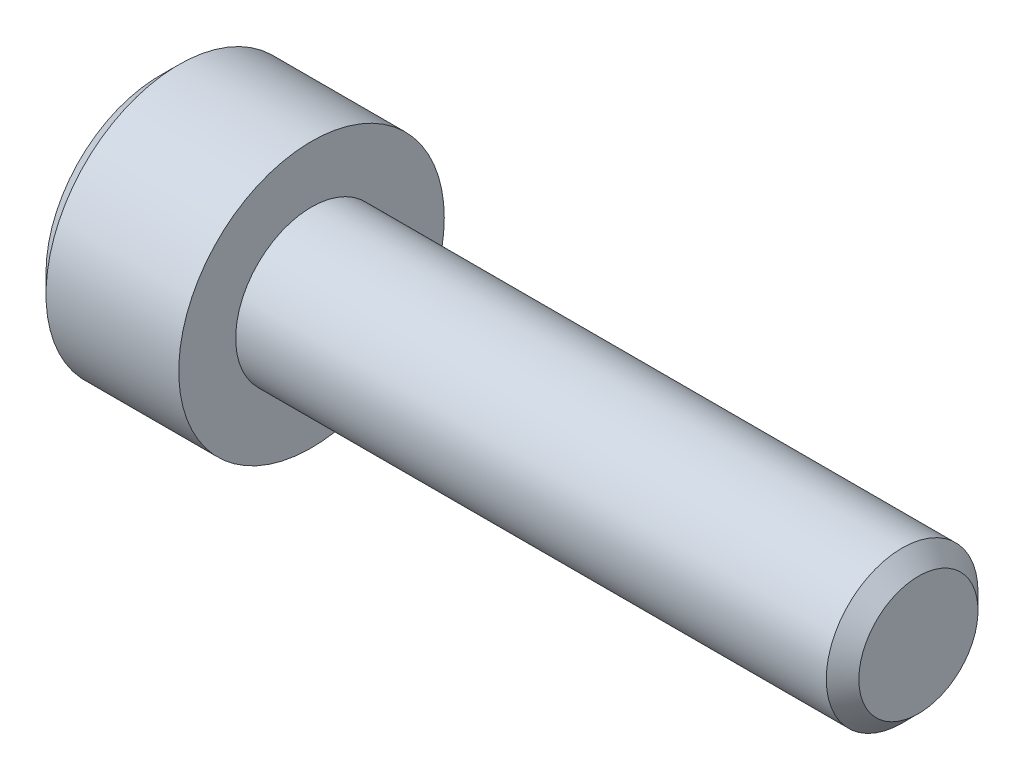
ISO-10303-21;
HEADER;
FILE_DESCRIPTION(('STEP AP214'),'2;1');
FILE_NAME('part.step','',(''),(''),'','','');
FILE_SCHEMA(('AUTOMOTIVE_DESIGN { 1 0 10303 214 1 1 1 1 }'));
ENDSEC;
DATA;
#1=APPLICATION_CONTEXT('core data for automotive mechanical design processes');
#2=APPLICATION_PROTOCOL_DEFINITION('international standard','automotive_design',2000,#1);
#3=PRODUCT_CONTEXT('',#1,'mechanical');
#4=PRODUCT('Part','Part','',(#3));
#5=PRODUCT_RELATED_PRODUCT_CATEGORY('part','',(#4));
#6=PRODUCT_DEFINITION_FORMATION('','',#4);
#7=PRODUCT_DEFINITION_CONTEXT('part definition',#1,'design');
#8=PRODUCT_DEFINITION('design','',#6,#7);
#9=PRODUCT_DEFINITION_SHAPE('','',#8);
#10=(LENGTH_UNIT() NAMED_UNIT(*) SI_UNIT(.MILLI.,.METRE.));
#11=(NAMED_UNIT(*) PLANE_ANGLE_UNIT() SI_UNIT($,.RADIAN.));
#12=(NAMED_UNIT(*) SI_UNIT($,.STERADIAN.) SOLID_ANGLE_UNIT());
#13=UNCERTAINTY_MEASURE_WITH_UNIT(LENGTH_MEASURE(1.E-05),#10,'distance_accuracy_value','');
#14=(GEOMETRIC_REPRESENTATION_CONTEXT(3) GLOBAL_UNCERTAINTY_ASSIGNED_CONTEXT((#13)) GLOBAL_UNIT_ASSIGNED_CONTEXT((#10,
#11,#12)) REPRESENTATION_CONTEXT('',''));
#15=CARTESIAN_POINT('',(0.,0.,0.));
#16=DIRECTION('',(0.,0.,1.));
#17=DIRECTION('',(1.,0.,0.));
#18=AXIS2_PLACEMENT_3D('',#15,#16,#17);
#19=CARTESIAN_POINT('',(0.,-1.7320508075689,0.));
#20=DIRECTION('',(0.,-0.866025403784433,-0.500000000000009));
#21=DIRECTION('',(0.,0.500000000000009,-0.866025403784433));
#22=AXIS2_PLACEMENT_3D('',#19,#20,#21);
#23=PLANE('',#22);
#24=DIRECTION('',(1.,0.,0.));
#25=VECTOR('',#24,1.);
#26=CARTESIAN_POINT('',(0.,-1.7320508075689,0.));
#27=LINE('',#26,#25);
#28=CARTESIAN_POINT('',(0.,-1.7320508075689,0.));
#29=VERTEX_POINT('',#28);
#30=CARTESIAN_POINT('',(2.,-1.7320508075689,0.));
#31=VERTEX_POINT('',#30);
#32=EDGE_CURVE('E83',#29,#31,#27,.T.);
#33=ORIENTED_EDGE('',*,*,#32,.T.);
#34=DIRECTION('',(0.,0.500000000000009,-0.866025403784433));
#35=VECTOR('',#34,1.);
#36=CARTESIAN_POINT('',(2.,-1.7320508075689,0.));
#37=LINE('',#36,#35);
#38=CARTESIAN_POINT('',(2.,-0.86602540378444,-1.5));
#39=VERTEX_POINT('',#38);
#40=EDGE_CURVE('E72',#39,#31,#37,.F.);
#41=ORIENTED_EDGE('',*,*,#40,.F.);
#42=DIRECTION('',(-1.,0.,0.));
#43=VECTOR('',#42,1.);
#44=CARTESIAN_POINT('',(0.,-0.86602540378444,-1.5));
#45=LINE('',#44,#43);
#46=CARTESIAN_POINT('',(0.,-0.86602540378444,-1.5));
#47=VERTEX_POINT('',#46);
#48=EDGE_CURVE('E92',#39,#47,#45,.T.);
#49=ORIENTED_EDGE('',*,*,#48,.T.);
#50=DIRECTION('',(0.,0.500000000000009,-0.866025403784433));
#51=VECTOR('',#50,1.);
#52=CARTESIAN_POINT('',(0.,-1.7320508075689,0.));
#53=LINE('',#52,#51);
#54=EDGE_CURVE('E67',#29,#47,#53,.T.);
#55=ORIENTED_EDGE('',*,*,#54,.F.);
#56=EDGE_LOOP('',(#33,#41,#49,#55));
#57=FACE_BOUND('',#56,.T.);
#58=ADVANCED_FACE('F17',(#57),#23,.F.);
#59=CARTESIAN_POINT('',(0.,-0.86602540378444,1.5));
#60=DIRECTION('',(0.,-0.866025403784433,0.500000000000009));
#61=DIRECTION('',(0.,-0.500000000000009,-0.866025403784433));
#62=AXIS2_PLACEMENT_3D('',#59,#60,#61);
#63=PLANE('',#62);
#64=DIRECTION('',(1.,0.,0.));
#65=VECTOR('',#64,1.);
#66=CARTESIAN_POINT('',(0.,-0.86602540378444,1.5));
#67=LINE('',#66,#65);
#68=CARTESIAN_POINT('',(0.,-0.86602540378444,1.5));
#69=VERTEX_POINT('',#68);
#70=CARTESIAN_POINT('',(2.,-0.86602540378444,1.5));
#71=VERTEX_POINT('',#70);
#72=EDGE_CURVE('E88',#69,#71,#67,.T.);
#73=ORIENTED_EDGE('',*,*,#72,.T.);
#74=DIRECTION('',(0.,-0.500000000000009,-0.866025403784433));
#75=VECTOR('',#74,1.);
#76=CARTESIAN_POINT('',(2.,-0.86602540378444,1.5));
#77=LINE('',#76,#75);
#78=EDGE_CURVE('E76',#31,#71,#77,.F.);
#79=ORIENTED_EDGE('',*,*,#78,.F.);
#80=ORIENTED_EDGE('',*,*,#32,.F.);
#81=DIRECTION('',(0.,-0.500000000000009,-0.866025403784433));
#82=VECTOR('',#81,1.);
#83=CARTESIAN_POINT('',(0.,-0.86602540378444,1.5));
#84=LINE('',#83,#82);
#85=EDGE_CURVE('E90',#69,#29,#84,.T.);
#86=ORIENTED_EDGE('',*,*,#85,.F.);
#87=EDGE_LOOP('',(#73,#79,#80,#86));
#88=FACE_BOUND('',#87,.T.);
#89=ADVANCED_FACE('F86',(#88),#63,.F.);
#90=CARTESIAN_POINT('',(0.,-0.86602540378444,-1.5));
#91=DIRECTION('',(0.,0.,-1.));
#92=DIRECTION('',(-1.,0.,0.));
#93=AXIS2_PLACEMENT_3D('',#90,#91,#92);
#94=PLANE('',#93);
#95=ORIENTED_EDGE('',*,*,#48,.F.);
#96=DIRECTION('',(0.,1.,0.));
#97=VECTOR('',#96,1.);
#98=CARTESIAN_POINT('',(2.,0.,-1.5));
#99=LINE('',#98,#97);
#100=CARTESIAN_POINT('',(2.,0.86602540378444,-1.5));
#101=VERTEX_POINT('',#100);
#102=EDGE_CURVE('E79',#39,#101,#99,.T.);
#103=ORIENTED_EDGE('',*,*,#102,.T.);
#104=DIRECTION('',(1.,0.,0.));
#105=VECTOR('',#104,1.);
#106=CARTESIAN_POINT('',(0.,0.86602540378444,-1.5));
#107=LINE('',#106,#105);
#108=CARTESIAN_POINT('',(0.,0.86602540378444,-1.5));
#109=VERTEX_POINT('',#108);
#110=EDGE_CURVE('E122',#101,#109,#107,.F.);
#111=ORIENTED_EDGE('',*,*,#110,.T.);
#112=DIRECTION('',(0.,1.,0.));
#113=VECTOR('',#112,1.);
#114=CARTESIAN_POINT('',(0.,-0.86602540378444,-1.5));
#115=LINE('',#114,#113);
#116=EDGE_CURVE('E134',#47,#109,#115,.T.);
#117=ORIENTED_EDGE('',*,*,#116,.F.);
#118=EDGE_LOOP('',(#95,#103,#111,#117));
#119=FACE_BOUND('',#118,.T.);
#120=ADVANCED_FACE('F137',(#119),#94,.F.);
#121=CARTESIAN_POINT('',(0.,0.86602540378444,1.5));
#122=DIRECTION('',(0.,0.,1.));
#123=DIRECTION('',(1.,0.,0.));
#124=AXIS2_PLACEMENT_3D('',#121,#122,#123);
#125=PLANE('',#124);
#126=DIRECTION('',(1.,0.,0.));
#127=VECTOR('',#126,1.);
#128=CARTESIAN_POINT('',(0.,0.86602540378444,1.5));
#129=LINE('',#128,#127);
#130=CARTESIAN_POINT('',(0.,0.86602540378444,1.5));
#131=VERTEX_POINT('',#130);
#132=CARTESIAN_POINT('',(2.,0.86602540378444,1.5));
#133=VERTEX_POINT('',#132);
#134=EDGE_CURVE('E119',#131,#133,#129,.T.);
#135=ORIENTED_EDGE('',*,*,#134,.T.);
#136=DIRECTION('',(0.,1.,0.));
#137=VECTOR('',#136,1.);
#138=CARTESIAN_POINT('',(2.,0.,1.5));
#139=LINE('',#138,#137);
#140=EDGE_CURVE('E127',#133,#71,#139,.F.);
#141=ORIENTED_EDGE('',*,*,#140,.T.);
#142=ORIENTED_EDGE('',*,*,#72,.F.);
#143=DIRECTION('',(0.,1.,0.));
#144=VECTOR('',#143,1.);
#145=CARTESIAN_POINT('',(0.,0.86602540378444,1.5));
#146=LINE('',#145,#144);
#147=EDGE_CURVE('E130',#131,#69,#146,.F.);
#148=ORIENTED_EDGE('',*,*,#147,.F.);
#149=EDGE_LOOP('',(#135,#141,#142,#148));
#150=FACE_BOUND('',#149,.T.);
#151=ADVANCED_FACE('F144',(#150),#125,.F.);
#152=CARTESIAN_POINT('',(2.,0.,0.));
#153=DIRECTION('',(1.,0.,0.));
#154=DIRECTION('',(0.,0.,-1.));
#155=AXIS2_PLACEMENT_3D('',#152,#153,#154);
#156=PLANE('',#155);
#157=ORIENTED_EDGE('',*,*,#140,.F.);
#158=DIRECTION('',(0.,-0.500000000000009,0.866025403784433));
#159=VECTOR('',#158,1.);
#160=CARTESIAN_POINT('',(2.,1.7320508075689,0.));
#161=LINE('',#160,#159);
#162=CARTESIAN_POINT('',(2.,1.7320508075689,0.));
#163=VERTEX_POINT('',#162);
#164=EDGE_CURVE('E117',#133,#163,#161,.F.);
#165=ORIENTED_EDGE('',*,*,#164,.T.);
#166=DIRECTION('',(0.,0.500000000000009,0.866025403784433));
#167=VECTOR('',#166,1.);
#168=CARTESIAN_POINT('',(2.,0.86602540378444,-1.5));
#169=LINE('',#168,#167);
#170=EDGE_CURVE('E125',#163,#101,#169,.F.);
#171=ORIENTED_EDGE('',*,*,#170,.T.);
#172=ORIENTED_EDGE('',*,*,#102,.F.);
#173=ORIENTED_EDGE('',*,*,#40,.T.);
#174=ORIENTED_EDGE('',*,*,#78,.T.);
#175=EDGE_LOOP('',(#157,#165,#171,#172,#173,#174));
#176=FACE_BOUND('',#175,.T.);
#177=ADVANCED_FACE('F74',(#176),#156,.F.);
#178=CARTESIAN_POINT('',(0.,0.86602540378444,-1.5));
#179=DIRECTION('',(0.,0.866025403784433,-0.500000000000009));
#180=DIRECTION('',(0.,0.500000000000009,0.866025403784433));
#181=AXIS2_PLACEMENT_3D('',#178,#179,#180);
#182=PLANE('',#181);
#183=ORIENTED_EDGE('',*,*,#110,.F.);
#184=ORIENTED_EDGE('',*,*,#170,.F.);
#185=DIRECTION('',(1.,0.,0.));
#186=VECTOR('',#185,1.);
#187=CARTESIAN_POINT('',(0.,1.7320508075689,0.));
#188=LINE('',#187,#186);
#189=CARTESIAN_POINT('',(0.,1.7320508075689,0.));
#190=VERTEX_POINT('',#189);
#191=EDGE_CURVE('E115',#163,#190,#188,.F.);
#192=ORIENTED_EDGE('',*,*,#191,.T.);
#193=DIRECTION('',(0.,0.500000000000009,0.866025403784433));
#194=VECTOR('',#193,1.);
#195=CARTESIAN_POINT('',(0.,0.86602540378444,-1.5));
#196=LINE('',#195,#194);
#197=EDGE_CURVE('E35',#109,#190,#196,.T.);
#198=ORIENTED_EDGE('',*,*,#197,.F.);
#199=EDGE_LOOP('',(#183,#184,#192,#198));
#200=FACE_BOUND('',#199,.T.);
#201=ADVANCED_FACE('F151',(#200),#182,.F.);
#202=CARTESIAN_POINT('',(0.,1.7320508075689,0.));
#203=DIRECTION('',(0.,0.866025403784433,0.500000000000009));
#204=DIRECTION('',(0.,-0.500000000000009,0.866025403784433));
#205=AXIS2_PLACEMENT_3D('',#202,#203,#204);
#206=PLANE('',#205);
#207=ORIENTED_EDGE('',*,*,#191,.F.);
#208=ORIENTED_EDGE('',*,*,#164,.F.);
#209=ORIENTED_EDGE('',*,*,#134,.F.);
#210=DIRECTION('',(0.,-0.500000000000009,0.866025403784433));
#211=VECTOR('',#210,1.);
#212=CARTESIAN_POINT('',(0.,1.7320508075689,0.));
#213=LINE('',#212,#211);
#214=EDGE_CURVE('E109',#190,#131,#213,.T.);
#215=ORIENTED_EDGE('',*,*,#214,.F.);
#216=EDGE_LOOP('',(#207,#208,#209,#215));
#217=FACE_BOUND('',#216,.T.);
#218=ADVANCED_FACE('F149',(#217),#206,.F.);
#219=CARTESIAN_POINT('',(0.,3.5,0.));
#220=DIRECTION('',(-1.,0.,0.));
#221=DIRECTION('',(0.,0.,1.));
#222=AXIS2_PLACEMENT_3D('',#219,#220,#221);
#223=PLANE('',#222);
#224=ORIENTED_EDGE('',*,*,#197,.T.);
#225=ORIENTED_EDGE('',*,*,#214,.T.);
#226=ORIENTED_EDGE('',*,*,#147,.T.);
#227=ORIENTED_EDGE('',*,*,#85,.T.);
#228=ORIENTED_EDGE('',*,*,#54,.T.);
#229=ORIENTED_EDGE('',*,*,#116,.T.);
#230=EDGE_LOOP('',(#224,#225,#226,#227,#228,#229));
#231=FACE_BOUND('',#230,.T.);
#232=CARTESIAN_POINT('',(0.,0.,0.));
#233=DIRECTION('',(1.,0.,0.));
#234=DIRECTION('',(0.,0.,-1.));
#235=AXIS2_PLACEMENT_3D('',#232,#233,#234);
#236=CIRCLE('',#235,2.9999999999859);
#237=CARTESIAN_POINT('',(0.,0.,-2.9999999999859));
#238=VERTEX_POINT('',#237);
#239=EDGE_CURVE('E20',#238,#238,#236,.T.);
#240=ORIENTED_EDGE('',*,*,#239,.F.);
#241=EDGE_LOOP('',(#240));
#242=FACE_BOUND('',#241,.T.);
#243=ADVANCED_FACE('F139',(#231,#242),#223,.T.);
#244=CARTESIAN_POINT('',(0.499999999988177,0.,0.));
#245=DIRECTION('',(1.,0.,0.));
#246=DIRECTION('',(0.,0.,-1.));
#247=AXIS2_PLACEMENT_3D('',#244,#245,#246);
#248=CONICAL_SURFACE('',#247,3.49999999997408,0.785398163397448);
#249=ORIENTED_EDGE('',*,*,#239,.T.);
#250=EDGE_LOOP('',(#249));
#251=FACE_BOUND('',#250,.T.);
#252=CARTESIAN_POINT('',(0.500000000000001,0.,0.));
#253=DIRECTION('',(1.,0.,0.));
#254=DIRECTION('',(0.,0.,-1.));
#255=AXIS2_PLACEMENT_3D('',#252,#253,#254);
#256=CIRCLE('',#255,3.5);
#257=CARTESIAN_POINT('',(0.500000000000001,0.,-3.5));
#258=VERTEX_POINT('',#257);
#259=EDGE_CURVE('E101',#258,#258,#256,.T.);
#260=ORIENTED_EDGE('',*,*,#259,.F.);
#261=EDGE_LOOP('',(#260));
#262=FACE_BOUND('',#261,.T.);
#263=ADVANCED_FACE('F182',(#251,#262),#248,.T.);
#264=CARTESIAN_POINT('',(20.,0.,0.));
#265=DIRECTION('',(1.,0.,0.));
#266=DIRECTION('',(0.,0.,-1.));
#267=AXIS2_PLACEMENT_3D('',#264,#265,#266);
#268=PLANE('',#267);
#269=CARTESIAN_POINT('',(19.9999999999818,0.,0.));
#270=DIRECTION('',(-1.,0.,0.));
#271=DIRECTION('',(0.,0.,1.));
#272=AXIS2_PLACEMENT_3D('',#269,#270,#271);
#273=CIRCLE('',#272,1.57050000012759);
#274=CARTESIAN_POINT('',(19.9999999999818,0.,1.57050000012759));
#275=VERTEX_POINT('',#274);
#276=EDGE_CURVE('E99',#275,#275,#273,.T.);
#277=ORIENTED_EDGE('',*,*,#276,.F.);
#278=EDGE_LOOP('',(#277));
#279=FACE_BOUND('',#278,.T.);
#280=ADVANCED_FACE('F179',(#279),#268,.T.);
#281=CARTESIAN_POINT('',(2.,0.,0.));
#282=DIRECTION('',(1.,0.,0.));
#283=DIRECTION('',(0.,0.,-1.));
#284=AXIS2_PLACEMENT_3D('',#281,#282,#283);
#285=CYLINDRICAL_SURFACE('',#284,3.5);
#286=ORIENTED_EDGE('',*,*,#259,.T.);
#287=EDGE_LOOP('',(#286));
#288=FACE_BOUND('',#287,.T.);
#289=CARTESIAN_POINT('',(4.,0.,0.));
#290=DIRECTION('',(1.,0.,0.));
#291=DIRECTION('',(0.,0.,-1.));
#292=AXIS2_PLACEMENT_3D('',#289,#290,#291);
#293=CIRCLE('',#292,3.5);
#294=CARTESIAN_POINT('',(4.,0.,-3.5));
#295=VERTEX_POINT('',#294);
#296=EDGE_CURVE('E97',#295,#295,#293,.T.);
#297=ORIENTED_EDGE('',*,*,#296,.F.);
#298=EDGE_LOOP('',(#297));
#299=FACE_BOUND('',#298,.T.);
#300=ADVANCED_FACE('F176',(#288,#299),#285,.T.);
#301=CARTESIAN_POINT('',(19.5705000000999,0.,0.));
#302=DIRECTION('',(-1.,0.,0.));
#303=DIRECTION('',(0.,0.,1.));
#304=AXIS2_PLACEMENT_3D('',#301,#302,#303);
#305=CONICAL_SURFACE('',#304,1.99999999995271,0.785398163331274);
#306=ORIENTED_EDGE('',*,*,#276,.T.);
#307=EDGE_LOOP('',(#306));
#308=FACE_BOUND('',#307,.T.);
#309=CARTESIAN_POINT('',(19.5705,0.,0.));
#310=DIRECTION('',(1.,0.,0.));
#311=DIRECTION('',(0.,0.,-1.));
#312=AXIS2_PLACEMENT_3D('',#309,#310,#311);
#313=CIRCLE('',#312,2.);
#314=CARTESIAN_POINT('',(19.5705,0.,-2.));
#315=VERTEX_POINT('',#314);
#316=EDGE_CURVE('E26',#315,#315,#313,.F.);
#317=ORIENTED_EDGE('',*,*,#316,.F.);
#318=EDGE_LOOP('',(#317));
#319=FACE_BOUND('',#318,.T.);
#320=ADVANCED_FACE('F169',(#308,#319),#305,.T.);
#321=CARTESIAN_POINT('',(4.,2.,0.));
#322=DIRECTION('',(1.,0.,0.));
#323=DIRECTION('',(0.,0.,-1.));
#324=AXIS2_PLACEMENT_3D('',#321,#322,#323);
#325=PLANE('',#324);
#326=CARTESIAN_POINT('',(4.,0.,0.));
#327=DIRECTION('',(1.,0.,0.));
#328=DIRECTION('',(0.,0.,-1.));
#329=AXIS2_PLACEMENT_3D('',#326,#327,#328);
#330=CIRCLE('',#329,2.);
#331=CARTESIAN_POINT('',(4.,0.,-2.));
#332=VERTEX_POINT('',#331);
#333=EDGE_CURVE('E11',#332,#332,#330,.T.);
#334=ORIENTED_EDGE('',*,*,#333,.F.);
#335=EDGE_LOOP('',(#334));
#336=FACE_BOUND('',#335,.T.);
#337=ORIENTED_EDGE('',*,*,#296,.T.);
#338=EDGE_LOOP('',(#337));
#339=FACE_BOUND('',#338,.T.);
#340=ADVANCED_FACE('F163',(#336,#339),#325,.T.);
#341=CARTESIAN_POINT('',(11.78525,0.,0.));
#342=DIRECTION('',(1.,0.,0.));
#343=DIRECTION('',(0.,0.,-1.));
#344=AXIS2_PLACEMENT_3D('',#341,#342,#343);
#345=CYLINDRICAL_SURFACE('',#344,2.);
#346=ORIENTED_EDGE('',*,*,#333,.T.);
#347=EDGE_LOOP('',(#346));
#348=FACE_BOUND('',#347,.T.);
#349=ORIENTED_EDGE('',*,*,#316,.T.);
#350=EDGE_LOOP('',(#349));
#351=FACE_BOUND('',#350,.T.);
#352=ADVANCED_FACE('F161',(#348,#351),#345,.T.);
#353=CLOSED_SHELL('',(#58,#89,#120,#151,#177,#201,#218,#243,#263,#280,#300,#320,#340,#352));
#354=MANIFOLD_SOLID_BREP('B1',#353);
#355=ADVANCED_BREP_SHAPE_REPRESENTATION('',(#18,#354),#14);
#356=SHAPE_DEFINITION_REPRESENTATION(#9,#355);
ENDSEC;
END-ISO-10303-21;
